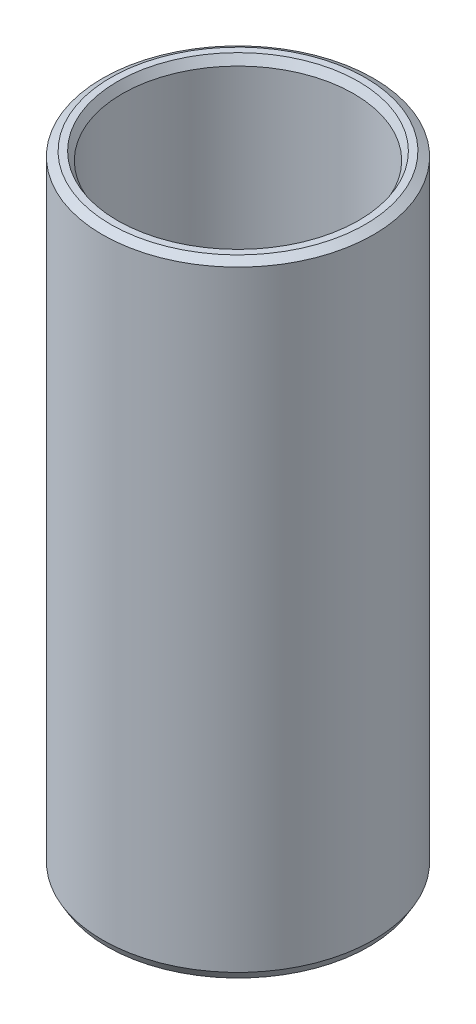
ISO-10303-21;
HEADER;
FILE_DESCRIPTION(('STEP AP214'),'2;1');
FILE_NAME('part.step','',(''),(''),'','','');
FILE_SCHEMA(('AUTOMOTIVE_DESIGN { 1 0 10303 214 1 1 1 1 }'));
ENDSEC;
DATA;
#1=APPLICATION_CONTEXT('core data for automotive mechanical design processes');
#2=APPLICATION_PROTOCOL_DEFINITION('international standard','automotive_design',2000,#1);
#3=PRODUCT_CONTEXT('',#1,'mechanical');
#4=PRODUCT('Part','Part','',(#3));
#5=PRODUCT_RELATED_PRODUCT_CATEGORY('part','',(#4));
#6=PRODUCT_DEFINITION_FORMATION('','',#4);
#7=PRODUCT_DEFINITION_CONTEXT('part definition',#1,'design');
#8=PRODUCT_DEFINITION('design','',#6,#7);
#9=PRODUCT_DEFINITION_SHAPE('','',#8);
#10=(LENGTH_UNIT() NAMED_UNIT(*) SI_UNIT(.MILLI.,.METRE.));
#11=(NAMED_UNIT(*) PLANE_ANGLE_UNIT() SI_UNIT($,.RADIAN.));
#12=(NAMED_UNIT(*) SI_UNIT($,.STERADIAN.) SOLID_ANGLE_UNIT());
#13=UNCERTAINTY_MEASURE_WITH_UNIT(LENGTH_MEASURE(1.E-05),#10,'distance_accuracy_value','');
#14=(GEOMETRIC_REPRESENTATION_CONTEXT(3) GLOBAL_UNCERTAINTY_ASSIGNED_CONTEXT((#13)) GLOBAL_UNIT_ASSIGNED_CONTEXT((#10,
#11,#12)) REPRESENTATION_CONTEXT('',''));
#15=CARTESIAN_POINT('',(0.,0.,0.));
#16=DIRECTION('',(0.,0.,1.));
#17=DIRECTION('',(1.,0.,0.));
#18=AXIS2_PLACEMENT_3D('',#15,#16,#17);
#19=CARTESIAN_POINT('',(0.,207.154820421448,0.));
#20=DIRECTION('',(0.,-1.,0.));
#21=DIRECTION('',(0.,0.,-1.));
#22=AXIS2_PLACEMENT_3D('',#19,#20,#21);
#23=CYLINDRICAL_SURFACE('',#22,45.);
#24=CARTESIAN_POINT('',(0.,2.73928903044657,0.));
#25=DIRECTION('',(0.,1.,0.));
#26=DIRECTION('',(0.,0.,1.));
#27=AXIS2_PLACEMENT_3D('',#24,#25,#26);
#28=CIRCLE('',#27,45.);
#29=CARTESIAN_POINT('',(0.,2.73928903044657,-45.));
#30=VERTEX_POINT('',#29);
#31=EDGE_CURVE('E10',#30,#30,#28,.T.);
#32=CARTESIAN_POINT('',(0.,205.573291162332,0.));
#33=DIRECTION('',(0.,1.,0.));
#34=DIRECTION('',(0.,0.,1.));
#35=AXIS2_PLACEMENT_3D('',#32,#33,#34);
#36=CIRCLE('',#35,45.);
#37=CARTESIAN_POINT('',(0.,205.573291162332,-45.));
#38=VERTEX_POINT('',#37);
#39=EDGE_CURVE('E50',#38,#38,#36,.F.);
#40=CARTESIAN_POINT('',(0.,2.73928903044657,-45.));
#41=CARTESIAN_POINT('',(0.,4.85214321932038,-45.));
#42=CARTESIAN_POINT('',(0.,6.96499740819417,-45.));
#43=CARTESIAN_POINT('',(0.,11.1907057859418,-45.));
#44=CARTESIAN_POINT('',(0.,13.3035599748156,-45.));
#45=CARTESIAN_POINT('',(0.,17.5292683525632,-45.));
#46=CARTESIAN_POINT('',(0.,19.642122541437,-45.));
#47=CARTESIAN_POINT('',(0.,23.8678309191846,-45.));
#48=CARTESIAN_POINT('',(0.,25.9806851080584,-45.));
#49=CARTESIAN_POINT('',(0.,30.206393485806,-45.));
#50=CARTESIAN_POINT('',(0.,32.3192476746798,-45.));
#51=CARTESIAN_POINT('',(0.,36.5449560524274,-45.));
#52=CARTESIAN_POINT('',(0.,38.6578102413013,-45.));
#53=CARTESIAN_POINT('',(0.,42.8835186190489,-45.));
#54=CARTESIAN_POINT('',(0.,44.9963728079227,-45.));
#55=CARTESIAN_POINT('',(0.,49.2220811856703,-45.));
#56=CARTESIAN_POINT('',(0.,51.3349353745441,-45.));
#57=CARTESIAN_POINT('',(0.,55.5606437522917,-45.));
#58=CARTESIAN_POINT('',(0.,57.6734979411655,-45.));
#59=CARTESIAN_POINT('',(0.,61.8992063189131,-45.));
#60=CARTESIAN_POINT('',(0.,64.0120605077869,-45.));
#61=CARTESIAN_POINT('',(0.,68.2377688855345,-45.));
#62=CARTESIAN_POINT('',(0.,70.3506230744083,-45.));
#63=CARTESIAN_POINT('',(0.,74.5763314521559,-45.));
#64=CARTESIAN_POINT('',(0.,76.6891856410298,-45.));
#65=CARTESIAN_POINT('',(0.,80.9148940187774,-45.));
#66=CARTESIAN_POINT('',(0.,83.0277482076511,-45.));
#67=CARTESIAN_POINT('',(0.,87.2534565853988,-45.));
#68=CARTESIAN_POINT('',(0.,89.3663107742726,-45.));
#69=CARTESIAN_POINT('',(0.,93.5920191520202,-45.));
#70=CARTESIAN_POINT('',(0.,95.704873340894,-45.));
#71=CARTESIAN_POINT('',(0.,99.9305817186416,-45.));
#72=CARTESIAN_POINT('',(0.,102.043435907515,-45.));
#73=CARTESIAN_POINT('',(0.,106.269144285263,-45.));
#74=CARTESIAN_POINT('',(0.,108.381998474137,-45.));
#75=CARTESIAN_POINT('',(0.,112.607706851884,-45.));
#76=CARTESIAN_POINT('',(0.,114.720561040758,-45.));
#77=CARTESIAN_POINT('',(0.,118.946269418506,-45.));
#78=CARTESIAN_POINT('',(0.,121.05912360738,-45.));
#79=CARTESIAN_POINT('',(0.,125.284831985127,-45.));
#80=CARTESIAN_POINT('',(0.,127.397686174001,-45.));
#81=CARTESIAN_POINT('',(0.,131.623394551749,-45.));
#82=CARTESIAN_POINT('',(0.,133.736248740622,-45.));
#83=CARTESIAN_POINT('',(0.,137.96195711837,-45.));
#84=CARTESIAN_POINT('',(0.,140.074811307244,-45.));
#85=CARTESIAN_POINT('',(0.,144.300519684992,-45.));
#86=CARTESIAN_POINT('',(0.,146.413373873865,-45.));
#87=CARTESIAN_POINT('',(0.,150.639082251613,-45.));
#88=CARTESIAN_POINT('',(0.,152.751936440487,-45.));
#89=CARTESIAN_POINT('',(0.,156.977644818234,-45.));
#90=CARTESIAN_POINT('',(0.,159.090499007108,-45.));
#91=CARTESIAN_POINT('',(0.,163.316207384856,-45.));
#92=CARTESIAN_POINT('',(0.,165.42906157373,-45.));
#93=CARTESIAN_POINT('',(0.,169.654769951477,-45.));
#94=CARTESIAN_POINT('',(0.,171.767624140351,-45.));
#95=CARTESIAN_POINT('',(0.,175.993332518099,-45.));
#96=CARTESIAN_POINT('',(0.,178.106186706972,-45.));
#97=CARTESIAN_POINT('',(0.,182.33189508472,-45.));
#98=CARTESIAN_POINT('',(0.,184.444749273594,-45.));
#99=CARTESIAN_POINT('',(0.,188.670457651341,-45.));
#100=CARTESIAN_POINT('',(0.,190.783311840215,-45.));
#101=CARTESIAN_POINT('',(0.,195.009020217963,-45.));
#102=CARTESIAN_POINT('',(0.,197.121874406837,-45.));
#103=CARTESIAN_POINT('',(0.,201.347582784584,-45.));
#104=CARTESIAN_POINT('',(0.,203.460436973458,-45.));
#105=CARTESIAN_POINT('',(0.,205.573291162332,-45.));
#106=B_SPLINE_CURVE_WITH_KNOTS('',3,(#40,#41,#42,#43,#44,#45,#46,#47,#48,#49,#50,#51,#52,#53,
#54,#55,#56,#57,#58,#59,#60,#61,#62,#63,#64,#65,#66,#67,#68,#69,#70,#71,#72,#73,#74,#75,#76,#77,
#78,#79,#80,#81,#82,#83,#84,#85,#86,#87,#88,#89,#90,#91,#92,#93,#94,#95,#96,#97,#98,#99,#100,
#101,#102,#103,#104,#105),.UNSPECIFIED.,.F.,.F.,(4,2,2,2,2,2,2,2,2,2,2,2,2,2,2,2,2,2,2,2,2,2,2,
2,2,2,2,2,2,2,2,2,4),(0.,6.33856256662141,12.6771251332428,19.0156876998643,25.3542502664857,
31.6928128331071,38.0313753997285,44.3699379663499,50.7085005329713,57.0470630995927,
63.3856256662141,69.7241882328356,76.062750799457,82.4013133660784,88.7398759326998,
95.0784384993212,101.417001065943,107.755563632564,114.094126199185,120.432688765807,
126.771251332428,133.10981389905,139.448376465671,145.786939032293,152.125501598914,
158.464064165535,164.802626732157,171.141189298778,177.4797518654,183.818314432021,
190.156876998642,196.495439565264,202.834002131885),.UNSPECIFIED.);
#107=EDGE_CURVE('BSEAM39',#30,#38,#106,.T.);
#108=ORIENTED_EDGE('',*,*,#31,.T.);
#109=ORIENTED_EDGE('',*,*,#39,.T.);
#110=ORIENTED_EDGE('',*,*,#107,.T.);
#111=ORIENTED_EDGE('',*,*,#107,.F.);
#112=EDGE_LOOP('',(#108,#110,#109,#111));
#113=FACE_BOUND('',#112,.T.);
#114=ADVANCED_FACE('F39',(#113),#23,.T.);
#115=CARTESIAN_POINT('',(0.,207.154820421448,0.));
#116=DIRECTION('',(0.,1.,0.));
#117=DIRECTION('',(0.,0.,1.));
#118=AXIS2_PLACEMENT_3D('',#115,#116,#117);
#119=PLANE('',#118);
#120=CARTESIAN_POINT('',(0.,207.154820421448,0.));
#121=DIRECTION('',(0.,1.,0.));
#122=DIRECTION('',(0.,0.,1.));
#123=AXIS2_PLACEMENT_3D('',#120,#121,#122);
#124=CIRCLE('',#123,40.0224142720932);
#125=CARTESIAN_POINT('',(0.,207.154820421448,40.0224142720932));
#126=VERTEX_POINT('',#125);
#127=EDGE_CURVE('E58',#126,#126,#124,.F.);
#128=ORIENTED_EDGE('',*,*,#127,.T.);
#129=EDGE_LOOP('',(#128));
#130=FACE_BOUND('',#129,.T.);
#131=CARTESIAN_POINT('',(0.,207.154820421448,0.));
#132=DIRECTION('',(0.,1.,0.));
#133=DIRECTION('',(0.,0.,1.));
#134=AXIS2_PLACEMENT_3D('',#131,#132,#133);
#135=CIRCLE('',#134,42.2607109695537);
#136=CARTESIAN_POINT('',(0.,207.154820421448,42.2607109695537));
#137=VERTEX_POINT('',#136);
#138=EDGE_CURVE('E61',#137,#137,#135,.T.);
#139=ORIENTED_EDGE('',*,*,#138,.T.);
#140=EDGE_LOOP('',(#139));
#141=FACE_BOUND('',#140,.T.);
#142=ADVANCED_FACE('F88',(#130,#141),#119,.T.);
#143=CARTESIAN_POINT('',(0.,0.,0.));
#144=DIRECTION('',(0.,1.,0.));
#145=DIRECTION('',(0.,0.,1.));
#146=AXIS2_PLACEMENT_3D('',#143,#144,#145);
#147=PLANE('',#146);
#148=CARTESIAN_POINT('',(0.,0.,0.));
#149=DIRECTION('',(0.,1.,0.));
#150=DIRECTION('',(0.,0.,1.));
#151=AXIS2_PLACEMENT_3D('',#148,#149,#150);
#152=CIRCLE('',#151,41.180174043423);
#153=CARTESIAN_POINT('',(0.,0.,41.180174043423));
#154=VERTEX_POINT('',#153);
#155=EDGE_CURVE('E51',#154,#154,#152,.T.);
#156=ORIENTED_EDGE('',*,*,#155,.T.);
#157=EDGE_LOOP('',(#156));
#158=FACE_BOUND('',#157,.T.);
#159=CARTESIAN_POINT('',(0.,0.,0.));
#160=DIRECTION('',(0.,1.,0.));
#161=DIRECTION('',(0.,0.,1.));
#162=AXIS2_PLACEMENT_3D('',#159,#160,#161);
#163=CIRCLE('',#162,43.4184707408835);
#164=CARTESIAN_POINT('',(0.,0.,43.4184707408835));
#165=VERTEX_POINT('',#164);
#166=EDGE_CURVE('E54',#165,#165,#163,.F.);
#167=ORIENTED_EDGE('',*,*,#166,.T.);
#168=EDGE_LOOP('',(#167));
#169=FACE_BOUND('',#168,.T.);
#170=ADVANCED_FACE('F83',(#158,#169),#147,.F.);
#171=CARTESIAN_POINT('',(0.,207.154820421448,0.));
#172=DIRECTION('',(0.,-1.,0.));
#173=DIRECTION('',(0.,0.,-1.));
#174=AXIS2_PLACEMENT_3D('',#171,#172,#173);
#175=CYLINDRICAL_SURFACE('',#174,38.4408850129767);
#176=CARTESIAN_POINT('',(0.,204.415531391002,0.));
#177=DIRECTION('',(0.,1.,0.));
#178=DIRECTION('',(0.,0.,1.));
#179=AXIS2_PLACEMENT_3D('',#176,#177,#178);
#180=CIRCLE('',#179,38.4408850129767);
#181=CARTESIAN_POINT('',(0.,204.415531391002,-38.4408850129767));
#182=VERTEX_POINT('',#181);
#183=EDGE_CURVE('E67',#182,#182,#180,.T.);
#184=CARTESIAN_POINT('',(0.,1.58152925911639,0.));
#185=DIRECTION('',(0.,1.,0.));
#186=DIRECTION('',(0.,0.,1.));
#187=AXIS2_PLACEMENT_3D('',#184,#185,#186);
#188=CIRCLE('',#187,38.4408850129767);
#189=CARTESIAN_POINT('',(0.,1.58152925911637,-38.4408850129767));
#190=VERTEX_POINT('',#189);
#191=EDGE_CURVE('E69',#190,#190,#188,.F.);
#192=CARTESIAN_POINT('',(0.,204.415531391002,-38.4408850129767));
#193=CARTESIAN_POINT('',(0.,202.302677202128,-38.4408850129767));
#194=CARTESIAN_POINT('',(0.,200.189823013254,-38.4408850129767));
#195=CARTESIAN_POINT('',(0.,195.964114635506,-38.4408850129767));
#196=CARTESIAN_POINT('',(0.,193.851260446633,-38.4408850129767));
#197=CARTESIAN_POINT('',(0.,189.625552068885,-38.4408850129767));
#198=CARTESIAN_POINT('',(0.,187.512697880011,-38.4408850129767));
#199=CARTESIAN_POINT('',(0.,183.286989502264,-38.4408850129767));
#200=CARTESIAN_POINT('',(0.,181.17413531339,-38.4408850129767));
#201=CARTESIAN_POINT('',(0.,176.948426935642,-38.4408850129767));
#202=CARTESIAN_POINT('',(0.,174.835572746768,-38.4408850129767));
#203=CARTESIAN_POINT('',(0.,170.609864369021,-38.4408850129767));
#204=CARTESIAN_POINT('',(0.,168.497010180147,-38.4408850129767));
#205=CARTESIAN_POINT('',(0.,164.271301802399,-38.4408850129767));
#206=CARTESIAN_POINT('',(0.,162.158447613526,-38.4408850129767));
#207=CARTESIAN_POINT('',(0.,157.932739235778,-38.4408850129767));
#208=CARTESIAN_POINT('',(0.,155.819885046904,-38.4408850129767));
#209=CARTESIAN_POINT('',(0.,151.594176669157,-38.4408850129767));
#210=CARTESIAN_POINT('',(0.,149.481322480283,-38.4408850129767));
#211=CARTESIAN_POINT('',(0.,145.255614102535,-38.4408850129767));
#212=CARTESIAN_POINT('',(0.,143.142759913661,-38.4408850129767));
#213=CARTESIAN_POINT('',(0.,138.917051535914,-38.4408850129767));
#214=CARTESIAN_POINT('',(0.,136.80419734704,-38.4408850129767));
#215=CARTESIAN_POINT('',(0.,132.578488969292,-38.4408850129767));
#216=CARTESIAN_POINT('',(0.,130.465634780418,-38.4408850129767));
#217=CARTESIAN_POINT('',(0.,126.239926402671,-38.4408850129767));
#218=CARTESIAN_POINT('',(0.,124.127072213797,-38.4408850129767));
#219=CARTESIAN_POINT('',(0.,119.901363836049,-38.4408850129767));
#220=CARTESIAN_POINT('',(0.,117.788509647176,-38.4408850129767));
#221=CARTESIAN_POINT('',(0.,113.562801269428,-38.4408850129767));
#222=CARTESIAN_POINT('',(0.,111.449947080554,-38.4408850129767));
#223=CARTESIAN_POINT('',(0.,107.224238702807,-38.4408850129767));
#224=CARTESIAN_POINT('',(0.,105.111384513933,-38.4408850129767));
#225=CARTESIAN_POINT('',(0.,100.885676136185,-38.4408850129767));
#226=CARTESIAN_POINT('',(0.,98.7728219473114,-38.4408850129767));
#227=CARTESIAN_POINT('',(0.,94.5471135695638,-38.4408850129767));
#228=CARTESIAN_POINT('',(0.,92.43425938069,-38.4408850129767));
#229=CARTESIAN_POINT('',(0.,88.2085510029424,-38.4408850129767));
#230=CARTESIAN_POINT('',(0.,86.0956968140686,-38.4408850129767));
#231=CARTESIAN_POINT('',(0.,81.869988436321,-38.4408850129767));
#232=CARTESIAN_POINT('',(0.,79.7571342474472,-38.4408850129767));
#233=CARTESIAN_POINT('',(0.,75.5314258696995,-38.4408850129767));
#234=CARTESIAN_POINT('',(0.,73.4185716808257,-38.4408850129767));
#235=CARTESIAN_POINT('',(0.,69.1928633030781,-38.4408850129767));
#236=CARTESIAN_POINT('',(0.,67.0800091142043,-38.4408850129767));
#237=CARTESIAN_POINT('',(0.,62.8543007364567,-38.4408850129767));
#238=CARTESIAN_POINT('',(0.,60.7414465475829,-38.4408850129767));
#239=CARTESIAN_POINT('',(0.,56.5157381698353,-38.4408850129767));
#240=CARTESIAN_POINT('',(0.,54.4028839809615,-38.4408850129767));
#241=CARTESIAN_POINT('',(0.,50.1771756032139,-38.4408850129767));
#242=CARTESIAN_POINT('',(0.,48.0643214143401,-38.4408850129767));
#243=CARTESIAN_POINT('',(0.,43.8386130365925,-38.4408850129767));
#244=CARTESIAN_POINT('',(0.,41.7257588477187,-38.4408850129767));
#245=CARTESIAN_POINT('',(0.,37.5000504699711,-38.4408850129767));
#246=CARTESIAN_POINT('',(0.,35.3871962810972,-38.4408850129767));
#247=CARTESIAN_POINT('',(0.,31.1614879033496,-38.4408850129767));
#248=CARTESIAN_POINT('',(0.,29.0486337144758,-38.4408850129767));
#249=CARTESIAN_POINT('',(0.,24.8229253367282,-38.4408850129767));
#250=CARTESIAN_POINT('',(0.,22.7100711478544,-38.4408850129767));
#251=CARTESIAN_POINT('',(0.,18.4843627701068,-38.4408850129767));
#252=CARTESIAN_POINT('',(0.,16.371508581233,-38.4408850129767));
#253=CARTESIAN_POINT('',(0.,12.1458002034854,-38.4408850129767));
#254=CARTESIAN_POINT('',(0.,10.0329460146116,-38.4408850129767));
#255=CARTESIAN_POINT('',(0.,5.80723763686397,-38.4408850129767));
#256=CARTESIAN_POINT('',(0.,3.69438344799017,-38.4408850129767));
#257=CARTESIAN_POINT('',(0.,1.58152925911637,-38.4408850129767));
#258=B_SPLINE_CURVE_WITH_KNOTS('',3,(#192,#193,#194,#195,#196,#197,#198,#199,#200,#201,#202,
#203,#204,#205,#206,#207,#208,#209,#210,#211,#212,#213,#214,#215,#216,#217,#218,#219,#220,#221,
#222,#223,#224,#225,#226,#227,#228,#229,#230,#231,#232,#233,#234,#235,#236,#237,#238,#239,#240,
#241,#242,#243,#244,#245,#246,#247,#248,#249,#250,#251,#252,#253,#254,#255,#256,#257),
.UNSPECIFIED.,.F.,.F.,(4,2,2,2,2,2,2,2,2,2,2,2,2,2,2,2,2,2,2,2,2,2,2,2,2,2,2,2,2,2,2,2,4),(0.,
6.33856256662141,12.6771251332428,19.0156876998642,25.3542502664856,31.6928128331071,
38.0313753997285,44.3699379663499,50.7085005329713,57.0470630995927,63.3856256662141,
69.7241882328355,76.062750799457,82.4013133660784,88.7398759326998,95.0784384993212,
101.417001065943,107.755563632564,114.094126199185,120.432688765807,126.771251332428,
133.10981389905,139.448376465671,145.786939032293,152.125501598914,158.464064165535,
164.802626732157,171.141189298778,177.4797518654,183.818314432021,190.156876998642,
196.495439565264,202.834002131885),.UNSPECIFIED.);
#259=EDGE_CURVE('BSEAM71',#182,#190,#258,.T.);
#260=ORIENTED_EDGE('',*,*,#183,.T.);
#261=ORIENTED_EDGE('',*,*,#191,.T.);
#262=ORIENTED_EDGE('',*,*,#259,.T.);
#263=ORIENTED_EDGE('',*,*,#259,.F.);
#264=EDGE_LOOP('',(#260,#262,#261,#263));
#265=FACE_BOUND('',#264,.T.);
#266=ADVANCED_FACE('F71',(#265),#175,.F.);
#267=CARTESIAN_POINT('',(0.,204.415531391002,0.));
#268=DIRECTION('',(0.,1.,0.));
#269=DIRECTION('',(0.,0.,1.));
#270=AXIS2_PLACEMENT_3D('',#267,#268,#269);
#271=CONICAL_SURFACE('',#270,38.4408850129767,0.523598775598295);
#272=ORIENTED_EDGE('',*,*,#127,.F.);
#273=EDGE_LOOP('',(#272));
#274=FACE_BOUND('',#273,.T.);
#275=ORIENTED_EDGE('',*,*,#183,.F.);
#276=EDGE_LOOP('',(#275));
#277=FACE_BOUND('',#276,.T.);
#278=ADVANCED_FACE('F77',(#274,#277),#271,.F.);
#279=CARTESIAN_POINT('',(0.,0.,0.));
#280=DIRECTION('',(0.,-1.,0.));
#281=DIRECTION('',(0.,0.,-1.));
#282=AXIS2_PLACEMENT_3D('',#279,#280,#281);
#283=CONICAL_SURFACE('',#282,41.180174043423,1.04719755119659);
#284=ORIENTED_EDGE('',*,*,#191,.F.);
#285=EDGE_LOOP('',(#284));
#286=FACE_BOUND('',#285,.T.);
#287=ORIENTED_EDGE('',*,*,#155,.F.);
#288=EDGE_LOOP('',(#287));
#289=FACE_BOUND('',#288,.T.);
#290=ADVANCED_FACE('F73',(#286,#289),#283,.F.);
#291=CARTESIAN_POINT('',(0.,2.73928903044657,0.));
#292=DIRECTION('',(0.,1.,0.));
#293=DIRECTION('',(0.,0.,1.));
#294=AXIS2_PLACEMENT_3D('',#291,#292,#293);
#295=CONICAL_SURFACE('',#294,45.,0.523598775598305);
#296=ORIENTED_EDGE('',*,*,#166,.F.);
#297=EDGE_LOOP('',(#296));
#298=FACE_BOUND('',#297,.T.);
#299=ORIENTED_EDGE('',*,*,#31,.F.);
#300=EDGE_LOOP('',(#299));
#301=FACE_BOUND('',#300,.T.);
#302=ADVANCED_FACE('F76',(#298,#301),#295,.T.);
#303=CARTESIAN_POINT('',(0.,207.154820421448,0.));
#304=DIRECTION('',(0.,-1.,0.));
#305=DIRECTION('',(0.,0.,-1.));
#306=AXIS2_PLACEMENT_3D('',#303,#304,#305);
#307=CONICAL_SURFACE('',#306,42.2607109695537,1.04719755119658);
#308=ORIENTED_EDGE('',*,*,#39,.F.);
#309=EDGE_LOOP('',(#308));
#310=FACE_BOUND('',#309,.T.);
#311=ORIENTED_EDGE('',*,*,#138,.F.);
#312=EDGE_LOOP('',(#311));
#313=FACE_BOUND('',#312,.T.);
#314=ADVANCED_FACE('F45',(#310,#313),#307,.T.);
#315=CLOSED_SHELL('',(#114,#142,#170,#266,#278,#290,#302,#314));
#316=MANIFOLD_SOLID_BREP('B2',#315);
#317=ADVANCED_BREP_SHAPE_REPRESENTATION('',(#18,#316),#14);
#318=SHAPE_DEFINITION_REPRESENTATION(#9,#317);
ENDSEC;
END-ISO-10303-21;
